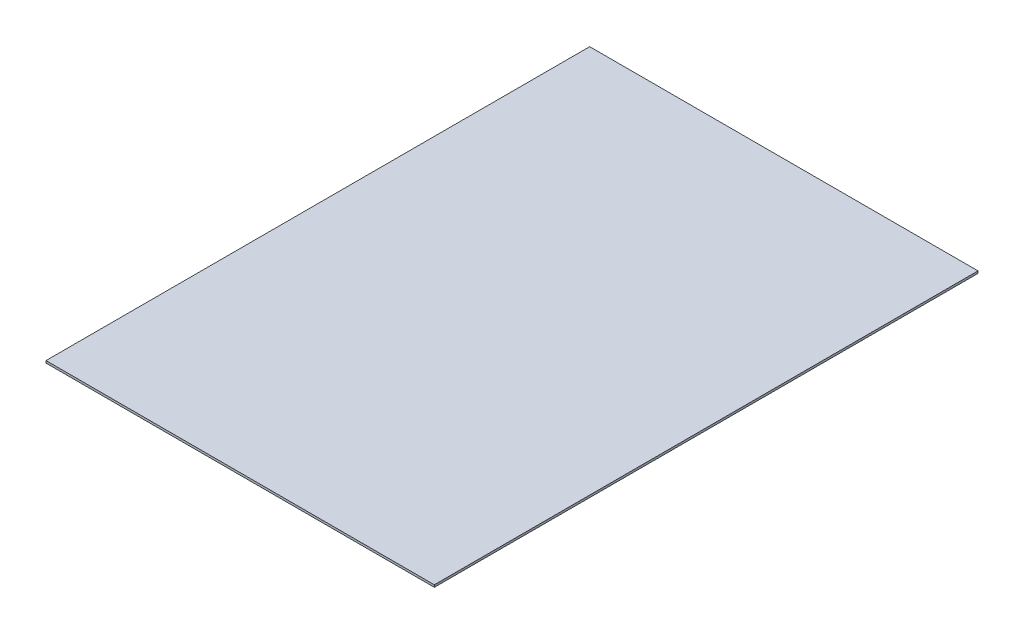
ISO-10303-21;
HEADER;
FILE_DESCRIPTION(('STEP AP214'),'2;1');
FILE_NAME('part.step','',(''),(''),'','','');
FILE_SCHEMA(('AUTOMOTIVE_DESIGN { 1 0 10303 214 1 1 1 1 }'));
ENDSEC;
DATA;
#1=APPLICATION_CONTEXT('core data for automotive mechanical design processes');
#2=APPLICATION_PROTOCOL_DEFINITION('international standard','automotive_design',2000,#1);
#3=PRODUCT_CONTEXT('',#1,'mechanical');
#4=PRODUCT('Part','Part','',(#3));
#5=PRODUCT_RELATED_PRODUCT_CATEGORY('part','',(#4));
#6=PRODUCT_DEFINITION_FORMATION('','',#4);
#7=PRODUCT_DEFINITION_CONTEXT('part definition',#1,'design');
#8=PRODUCT_DEFINITION('design','',#6,#7);
#9=PRODUCT_DEFINITION_SHAPE('','',#8);
#10=(LENGTH_UNIT() NAMED_UNIT(*) SI_UNIT(.MILLI.,.METRE.));
#11=(NAMED_UNIT(*) PLANE_ANGLE_UNIT() SI_UNIT($,.RADIAN.));
#12=(NAMED_UNIT(*) SI_UNIT($,.STERADIAN.) SOLID_ANGLE_UNIT());
#13=UNCERTAINTY_MEASURE_WITH_UNIT(LENGTH_MEASURE(1.E-05),#10,'distance_accuracy_value','');
#14=(GEOMETRIC_REPRESENTATION_CONTEXT(3) GLOBAL_UNCERTAINTY_ASSIGNED_CONTEXT((#13)) GLOBAL_UNIT_ASSIGNED_CONTEXT((#10,
#11,#12)) REPRESENTATION_CONTEXT('',''));
#15=CARTESIAN_POINT('',(0.,0.,0.));
#16=DIRECTION('',(0.,0.,1.));
#17=DIRECTION('',(1.,0.,0.));
#18=AXIS2_PLACEMENT_3D('',#15,#16,#17);
#19=CARTESIAN_POINT('',(87.5,1.,-122.5));
#20=DIRECTION('',(-1.,0.,0.));
#21=DIRECTION('',(0.,0.,1.));
#22=AXIS2_PLACEMENT_3D('',#19,#20,#21);
#23=PLANE('',#22);
#24=DIRECTION('',(0.,0.,-1.));
#25=VECTOR('',#24,1.);
#26=CARTESIAN_POINT('',(87.5,0.,-122.5));
#27=LINE('',#26,#25);
#28=CARTESIAN_POINT('',(87.5,0.,122.5));
#29=VERTEX_POINT('',#28);
#30=CARTESIAN_POINT('',(87.5,0.,-122.5));
#31=VERTEX_POINT('',#30);
#32=EDGE_CURVE('E99',#29,#31,#27,.T.);
#33=ORIENTED_EDGE('',*,*,#32,.T.);
#34=DIRECTION('',(0.,-1.,0.));
#35=VECTOR('',#34,1.);
#36=CARTESIAN_POINT('',(87.5,1.,-122.5));
#37=LINE('',#36,#35);
#38=CARTESIAN_POINT('',(87.5,1.,-122.5));
#39=VERTEX_POINT('',#38);
#40=EDGE_CURVE('E11',#39,#31,#37,.T.);
#41=ORIENTED_EDGE('',*,*,#40,.F.);
#42=DIRECTION('',(0.,0.,-1.));
#43=VECTOR('',#42,1.);
#44=CARTESIAN_POINT('',(87.5,1.,-122.5));
#45=LINE('',#44,#43);
#46=CARTESIAN_POINT('',(87.5,1.,122.5));
#47=VERTEX_POINT('',#46);
#48=EDGE_CURVE('E87',#47,#39,#45,.T.);
#49=ORIENTED_EDGE('',*,*,#48,.F.);
#50=DIRECTION('',(0.,-1.,0.));
#51=VECTOR('',#50,1.);
#52=CARTESIAN_POINT('',(87.5,1.,122.5));
#53=LINE('',#52,#51);
#54=EDGE_CURVE('E95',#47,#29,#53,.T.);
#55=ORIENTED_EDGE('',*,*,#54,.T.);
#56=EDGE_LOOP('',(#33,#41,#49,#55));
#57=FACE_BOUND('',#56,.T.);
#58=ADVANCED_FACE('F36',(#57),#23,.F.);
#59=CARTESIAN_POINT('',(-87.5,1.,-122.5));
#60=DIRECTION('',(0.,0.,1.));
#61=DIRECTION('',(1.,0.,0.));
#62=AXIS2_PLACEMENT_3D('',#59,#60,#61);
#63=PLANE('',#62);
#64=DIRECTION('',(-1.,0.,0.));
#65=VECTOR('',#64,1.);
#66=CARTESIAN_POINT('',(-87.5,0.,-122.5));
#67=LINE('',#66,#65);
#68=CARTESIAN_POINT('',(-87.5,0.,-122.5));
#69=VERTEX_POINT('',#68);
#70=EDGE_CURVE('E91',#31,#69,#67,.T.);
#71=ORIENTED_EDGE('',*,*,#70,.T.);
#72=DIRECTION('',(0.,-1.,0.));
#73=VECTOR('',#72,1.);
#74=CARTESIAN_POINT('',(-87.5,1.,-122.5));
#75=LINE('',#74,#73);
#76=CARTESIAN_POINT('',(-87.5,1.,-122.5));
#77=VERTEX_POINT('',#76);
#78=EDGE_CURVE('E44',#77,#69,#75,.T.);
#79=ORIENTED_EDGE('',*,*,#78,.F.);
#80=DIRECTION('',(-1.,0.,0.));
#81=VECTOR('',#80,1.);
#82=CARTESIAN_POINT('',(-87.5,1.,-122.5));
#83=LINE('',#82,#81);
#84=EDGE_CURVE('E82',#39,#77,#83,.T.);
#85=ORIENTED_EDGE('',*,*,#84,.F.);
#86=ORIENTED_EDGE('',*,*,#40,.T.);
#87=EDGE_LOOP('',(#71,#79,#85,#86));
#88=FACE_BOUND('',#87,.T.);
#89=ADVANCED_FACE('F90',(#88),#63,.F.);
#90=CARTESIAN_POINT('',(-87.5,1.,-122.5));
#91=DIRECTION('',(1.,0.,0.));
#92=DIRECTION('',(0.,0.,-1.));
#93=AXIS2_PLACEMENT_3D('',#90,#91,#92);
#94=PLANE('',#93);
#95=DIRECTION('',(0.,0.,1.));
#96=VECTOR('',#95,1.);
#97=CARTESIAN_POINT('',(-87.5,0.,-122.5));
#98=LINE('',#97,#96);
#99=CARTESIAN_POINT('',(-87.5,0.,122.5));
#100=VERTEX_POINT('',#99);
#101=EDGE_CURVE('E69',#69,#100,#98,.T.);
#102=ORIENTED_EDGE('',*,*,#101,.T.);
#103=DIRECTION('',(0.,-1.,0.));
#104=VECTOR('',#103,1.);
#105=CARTESIAN_POINT('',(-87.5,1.,122.5));
#106=LINE('',#105,#104);
#107=CARTESIAN_POINT('',(-87.5,1.,122.5));
#108=VERTEX_POINT('',#107);
#109=EDGE_CURVE('E92',#108,#100,#106,.T.);
#110=ORIENTED_EDGE('',*,*,#109,.F.);
#111=DIRECTION('',(0.,0.,1.));
#112=VECTOR('',#111,1.);
#113=CARTESIAN_POINT('',(-87.5,1.,-122.5));
#114=LINE('',#113,#112);
#115=EDGE_CURVE('E85',#77,#108,#114,.T.);
#116=ORIENTED_EDGE('',*,*,#115,.F.);
#117=ORIENTED_EDGE('',*,*,#78,.T.);
#118=EDGE_LOOP('',(#102,#110,#116,#117));
#119=FACE_BOUND('',#118,.T.);
#120=ADVANCED_FACE('F93',(#119),#94,.F.);
#121=CARTESIAN_POINT('',(-87.5,1.,122.5));
#122=DIRECTION('',(0.,0.,-1.));
#123=DIRECTION('',(-1.,0.,0.));
#124=AXIS2_PLACEMENT_3D('',#121,#122,#123);
#125=PLANE('',#124);
#126=DIRECTION('',(1.,0.,0.));
#127=VECTOR('',#126,1.);
#128=CARTESIAN_POINT('',(-87.5,0.,122.5));
#129=LINE('',#128,#127);
#130=EDGE_CURVE('E75',#100,#29,#129,.T.);
#131=ORIENTED_EDGE('',*,*,#130,.T.);
#132=ORIENTED_EDGE('',*,*,#54,.F.);
#133=DIRECTION('',(1.,0.,0.));
#134=VECTOR('',#133,1.);
#135=CARTESIAN_POINT('',(-87.5,1.,122.5));
#136=LINE('',#135,#134);
#137=EDGE_CURVE('E52',#108,#47,#136,.T.);
#138=ORIENTED_EDGE('',*,*,#137,.F.);
#139=ORIENTED_EDGE('',*,*,#109,.T.);
#140=EDGE_LOOP('',(#131,#132,#138,#139));
#141=FACE_BOUND('',#140,.T.);
#142=ADVANCED_FACE('F106',(#141),#125,.F.);
#143=CARTESIAN_POINT('',(0.,1.,0.));
#144=DIRECTION('',(0.,1.,0.));
#145=DIRECTION('',(0.,0.,1.));
#146=AXIS2_PLACEMENT_3D('',#143,#144,#145);
#147=PLANE('',#146);
#148=ORIENTED_EDGE('',*,*,#48,.T.);
#149=ORIENTED_EDGE('',*,*,#84,.T.);
#150=ORIENTED_EDGE('',*,*,#115,.T.);
#151=ORIENTED_EDGE('',*,*,#137,.T.);
#152=EDGE_LOOP('',(#148,#149,#150,#151));
#153=FACE_BOUND('',#152,.T.);
#154=ADVANCED_FACE('F83',(#153),#147,.T.);
#155=CARTESIAN_POINT('',(0.,0.,0.));
#156=DIRECTION('',(0.,1.,0.));
#157=DIRECTION('',(0.,0.,1.));
#158=AXIS2_PLACEMENT_3D('',#155,#156,#157);
#159=PLANE('',#158);
#160=ORIENTED_EDGE('',*,*,#32,.F.);
#161=ORIENTED_EDGE('',*,*,#130,.F.);
#162=ORIENTED_EDGE('',*,*,#101,.F.);
#163=ORIENTED_EDGE('',*,*,#70,.F.);
#164=EDGE_LOOP('',(#160,#161,#162,#163));
#165=FACE_BOUND('',#164,.T.);
#166=ADVANCED_FACE('F109',(#165),#159,.F.);
#167=CLOSED_SHELL('',(#58,#89,#120,#142,#154,#166));
#168=MANIFOLD_SOLID_BREP('B2',#167);
#169=ADVANCED_BREP_SHAPE_REPRESENTATION('',(#18,#168),#14);
#170=SHAPE_DEFINITION_REPRESENTATION(#9,#169);
ENDSEC;
END-ISO-10303-21;
